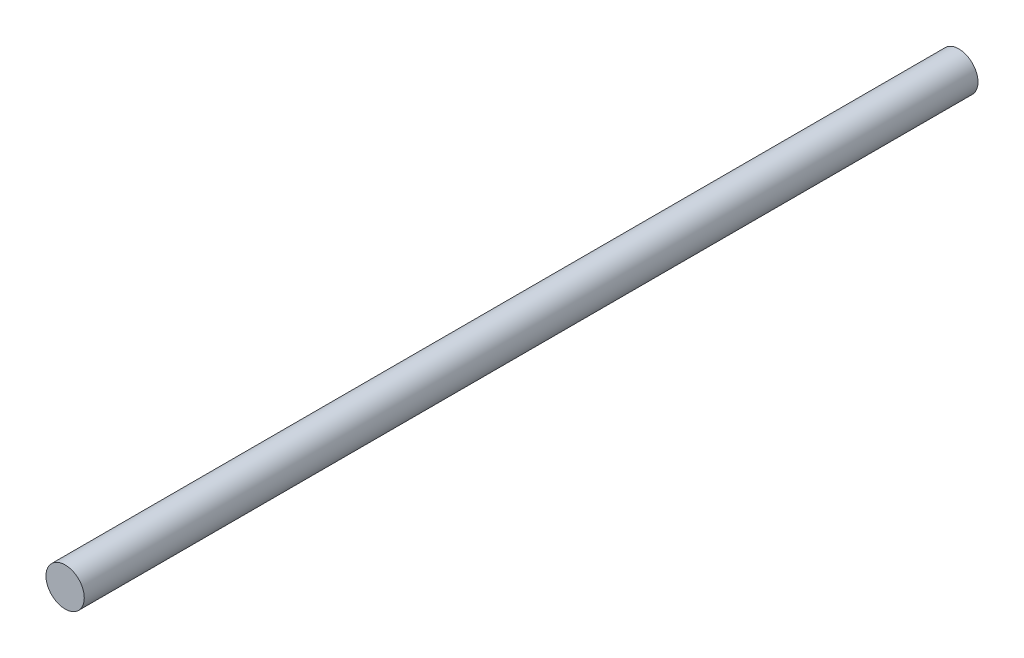
ISO-10303-21;
HEADER;
FILE_DESCRIPTION(('STEP AP214'),'2;1');
FILE_NAME('part.step','',(''),(''),'','','');
FILE_SCHEMA(('AUTOMOTIVE_DESIGN { 1 0 10303 214 1 1 1 1 }'));
ENDSEC;
DATA;
#1=APPLICATION_CONTEXT('core data for automotive mechanical design processes');
#2=APPLICATION_PROTOCOL_DEFINITION('international standard','automotive_design',2000,#1);
#3=PRODUCT_CONTEXT('',#1,'mechanical');
#4=PRODUCT('Part','Part','',(#3));
#5=PRODUCT_RELATED_PRODUCT_CATEGORY('part','',(#4));
#6=PRODUCT_DEFINITION_FORMATION('','',#4);
#7=PRODUCT_DEFINITION_CONTEXT('part definition',#1,'design');
#8=PRODUCT_DEFINITION('design','',#6,#7);
#9=PRODUCT_DEFINITION_SHAPE('','',#8);
#10=(LENGTH_UNIT() NAMED_UNIT(*) SI_UNIT(.MILLI.,.METRE.));
#11=(NAMED_UNIT(*) PLANE_ANGLE_UNIT() SI_UNIT($,.RADIAN.));
#12=(NAMED_UNIT(*) SI_UNIT($,.STERADIAN.) SOLID_ANGLE_UNIT());
#13=UNCERTAINTY_MEASURE_WITH_UNIT(LENGTH_MEASURE(1.E-05),#10,'distance_accuracy_value','');
#14=(GEOMETRIC_REPRESENTATION_CONTEXT(3) GLOBAL_UNCERTAINTY_ASSIGNED_CONTEXT((#13)) GLOBAL_UNIT_ASSIGNED_CONTEXT((#10,
#11,#12)) REPRESENTATION_CONTEXT('',''));
#15=CARTESIAN_POINT('',(0.,0.,0.));
#16=DIRECTION('',(0.,0.,1.));
#17=DIRECTION('',(1.,0.,0.));
#18=AXIS2_PLACEMENT_3D('',#15,#16,#17);
#19=CARTESIAN_POINT('',(0.,0.,140.));
#20=DIRECTION('',(0.,0.,-1.));
#21=DIRECTION('',(-1.,0.,0.));
#22=AXIS2_PLACEMENT_3D('',#19,#20,#21);
#23=CYLINDRICAL_SURFACE('',#22,3.);
#24=CARTESIAN_POINT('',(0.,0.,140.));
#25=DIRECTION('',(0.,0.,1.));
#26=DIRECTION('',(1.,0.,0.));
#27=AXIS2_PLACEMENT_3D('',#24,#25,#26);
#28=CIRCLE('',#27,3.);
#29=CARTESIAN_POINT('',(3.,0.,140.));
#30=VERTEX_POINT('',#29);
#31=EDGE_CURVE('E10',#30,#30,#28,.T.);
#32=ORIENTED_EDGE('',*,*,#31,.F.);
#33=EDGE_LOOP('',(#32));
#34=FACE_BOUND('',#33,.T.);
#35=CARTESIAN_POINT('',(0.,0.,0.));
#36=DIRECTION('',(0.,0.,1.));
#37=DIRECTION('',(1.,0.,0.));
#38=AXIS2_PLACEMENT_3D('',#35,#36,#37);
#39=CIRCLE('',#38,3.);
#40=CARTESIAN_POINT('',(3.,0.,0.));
#41=VERTEX_POINT('',#40);
#42=EDGE_CURVE('E40',#41,#41,#39,.T.);
#43=ORIENTED_EDGE('',*,*,#42,.T.);
#44=EDGE_LOOP('',(#43));
#45=FACE_BOUND('',#44,.T.);
#46=ADVANCED_FACE('F37',(#34,#45),#23,.T.);
#47=CARTESIAN_POINT('',(0.,0.,140.));
#48=DIRECTION('',(0.,0.,1.));
#49=DIRECTION('',(1.,0.,0.));
#50=AXIS2_PLACEMENT_3D('',#47,#48,#49);
#51=PLANE('',#50);
#52=ORIENTED_EDGE('',*,*,#31,.T.);
#53=EDGE_LOOP('',(#52));
#54=FACE_BOUND('',#53,.T.);
#55=ADVANCED_FACE('F54',(#54),#51,.T.);
#56=CARTESIAN_POINT('',(0.,0.,0.));
#57=DIRECTION('',(0.,0.,1.));
#58=DIRECTION('',(1.,0.,0.));
#59=AXIS2_PLACEMENT_3D('',#56,#57,#58);
#60=PLANE('',#59);
#61=ORIENTED_EDGE('',*,*,#42,.F.);
#62=EDGE_LOOP('',(#61));
#63=FACE_BOUND('',#62,.T.);
#64=ADVANCED_FACE('F52',(#63),#60,.F.);
#65=CLOSED_SHELL('',(#46,#55,#64));
#66=MANIFOLD_SOLID_BREP('B2',#65);
#67=ADVANCED_BREP_SHAPE_REPRESENTATION('',(#18,#66),#14);
#68=SHAPE_DEFINITION_REPRESENTATION(#9,#67);
ENDSEC;
END-ISO-10303-21;
